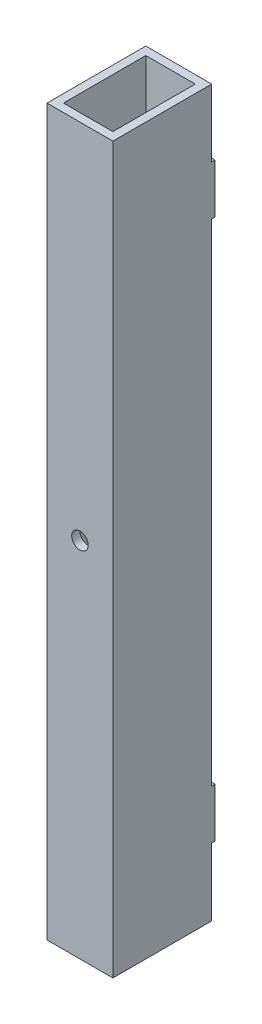
ISO-10303-21;
HEADER;
FILE_DESCRIPTION(('STEP AP214'),'2;1');
FILE_NAME('part.step','',(''),(''),'','','');
FILE_SCHEMA(('AUTOMOTIVE_DESIGN { 1 0 10303 214 1 1 1 1 }'));
ENDSEC;
DATA;
#1=APPLICATION_CONTEXT('core data for automotive mechanical design processes');
#2=APPLICATION_PROTOCOL_DEFINITION('international standard','automotive_design',2000,#1);
#3=PRODUCT_CONTEXT('',#1,'mechanical');
#4=PRODUCT('Part','Part','',(#3));
#5=PRODUCT_RELATED_PRODUCT_CATEGORY('part','',(#4));
#6=PRODUCT_DEFINITION_FORMATION('','',#4);
#7=PRODUCT_DEFINITION_CONTEXT('part definition',#1,'design');
#8=PRODUCT_DEFINITION('design','',#6,#7);
#9=PRODUCT_DEFINITION_SHAPE('','',#8);
#10=(LENGTH_UNIT() NAMED_UNIT(*) SI_UNIT(.MILLI.,.METRE.));
#11=(NAMED_UNIT(*) PLANE_ANGLE_UNIT() SI_UNIT($,.RADIAN.));
#12=(NAMED_UNIT(*) SI_UNIT($,.STERADIAN.) SOLID_ANGLE_UNIT());
#13=UNCERTAINTY_MEASURE_WITH_UNIT(LENGTH_MEASURE(1.E-05),#10,'distance_accuracy_value','');
#14=(GEOMETRIC_REPRESENTATION_CONTEXT(3) GLOBAL_UNCERTAINTY_ASSIGNED_CONTEXT((#13)) GLOBAL_UNIT_ASSIGNED_CONTEXT((#10,
#11,#12)) REPRESENTATION_CONTEXT('',''));
#15=CARTESIAN_POINT('',(0.,0.,0.));
#16=DIRECTION('',(0.,0.,1.));
#17=DIRECTION('',(1.,0.,0.));
#18=AXIS2_PLACEMENT_3D('',#15,#16,#17);
#19=CARTESIAN_POINT('',(-25.4,279.4,-38.1));
#20=DIRECTION('',(0.,0.,1.));
#21=DIRECTION('',(1.,0.,0.));
#22=AXIS2_PLACEMENT_3D('',#19,#20,#21);
#23=PLANE('',#22);
#24=CARTESIAN_POINT('',(0.,0.,-38.1));
#25=DIRECTION('',(0.,0.,1.));
#26=DIRECTION('',(1.,0.,0.));
#27=AXIS2_PLACEMENT_3D('',#24,#25,#26);
#28=CIRCLE('',#27,6.35);
#29=CARTESIAN_POINT('',(6.35,0.,-38.1));
#30=VERTEX_POINT('',#29);
#31=EDGE_CURVE('E239',#30,#30,#28,.T.);
#32=ORIENTED_EDGE('',*,*,#31,.T.);
#33=EDGE_LOOP('',(#32));
#34=FACE_BOUND('',#33,.T.);
#35=DIRECTION('',(0.,-1.,0.));
#36=VECTOR('',#35,1.);
#37=CARTESIAN_POINT('',(-25.4,279.4,-38.1));
#38=LINE('',#37,#36);
#39=CARTESIAN_POINT('',(-25.4,189.336065815908,-38.1));
#40=VERTEX_POINT('',#39);
#41=CARTESIAN_POINT('',(-25.4,-189.336065815908,-38.1));
#42=VERTEX_POINT('',#41);
#43=EDGE_CURVE('E221',#40,#42,#38,.T.);
#44=ORIENTED_EDGE('',*,*,#43,.F.);
#45=DIRECTION('',(1.,0.,0.));
#46=VECTOR('',#45,1.);
#47=CARTESIAN_POINT('',(25.4,189.336065815908,-38.1));
#48=LINE('',#47,#46);
#49=CARTESIAN_POINT('',(25.4,189.336065815908,-38.1));
#50=VERTEX_POINT('',#49);
#51=EDGE_CURVE('E51',#40,#50,#48,.T.);
#52=ORIENTED_EDGE('',*,*,#51,.T.);
#53=DIRECTION('',(0.,-1.,0.));
#54=VECTOR('',#53,1.);
#55=CARTESIAN_POINT('',(25.4,279.4,-38.1));
#56=LINE('',#55,#54);
#57=CARTESIAN_POINT('',(25.4,-189.336065815908,-38.1));
#58=VERTEX_POINT('',#57);
#59=EDGE_CURVE('E38',#50,#58,#56,.T.);
#60=ORIENTED_EDGE('',*,*,#59,.T.);
#61=DIRECTION('',(1.,0.,0.));
#62=VECTOR('',#61,1.);
#63=CARTESIAN_POINT('',(25.4,-189.336065815908,-38.1));
#64=LINE('',#63,#62);
#65=EDGE_CURVE('E186',#42,#58,#64,.T.);
#66=ORIENTED_EDGE('',*,*,#65,.F.);
#67=EDGE_LOOP('',(#44,#52,#60,#66));
#68=FACE_BOUND('',#67,.T.);
#69=ADVANCED_FACE('F34',(#34,#68),#23,.F.);
#70=CARTESIAN_POINT('',(25.4,279.4,-38.1));
#71=VERTEX_POINT('',#70);
#72=CARTESIAN_POINT('',(25.4,227.436065815908,-38.1));
#73=VERTEX_POINT('',#72);
#74=EDGE_CURVE('E11',#71,#73,#56,.T.);
#75=ORIENTED_EDGE('',*,*,#74,.T.);
#76=DIRECTION('',(-1.,0.,0.));
#77=VECTOR('',#76,1.);
#78=CARTESIAN_POINT('',(25.4,227.436065815908,-38.1));
#79=LINE('',#78,#77);
#80=CARTESIAN_POINT('',(-25.4,227.436065815908,-38.1));
#81=VERTEX_POINT('',#80);
#82=EDGE_CURVE('E166',#73,#81,#79,.T.);
#83=ORIENTED_EDGE('',*,*,#82,.T.);
#84=CARTESIAN_POINT('',(-25.4,279.4,-38.1));
#85=VERTEX_POINT('',#84);
#86=EDGE_CURVE('E223',#85,#81,#38,.T.);
#87=ORIENTED_EDGE('',*,*,#86,.F.);
#88=DIRECTION('',(-1.,0.,0.));
#89=VECTOR('',#88,1.);
#90=CARTESIAN_POINT('',(-25.4,279.4,-38.1));
#91=LINE('',#90,#89);
#92=EDGE_CURVE('E285',#71,#85,#91,.T.);
#93=ORIENTED_EDGE('',*,*,#92,.F.);
#94=EDGE_LOOP('',(#75,#83,#87,#93));
#95=FACE_BOUND('',#94,.T.);
#96=ADVANCED_FACE('F326',(#95),#23,.F.);
#97=DIRECTION('',(-1.,0.,0.));
#98=VECTOR('',#97,1.);
#99=CARTESIAN_POINT('',(25.4,-227.436065815908,-38.1));
#100=LINE('',#99,#98);
#101=CARTESIAN_POINT('',(25.4,-227.436065815908,-38.1));
#102=VERTEX_POINT('',#101);
#103=CARTESIAN_POINT('',(-25.4,-227.436065815908,-38.1));
#104=VERTEX_POINT('',#103);
#105=EDGE_CURVE('E59',#102,#104,#100,.T.);
#106=ORIENTED_EDGE('',*,*,#105,.F.);
#107=CARTESIAN_POINT('',(25.4,-279.4,-38.1));
#108=VERTEX_POINT('',#107);
#109=EDGE_CURVE('E200',#102,#108,#56,.T.);
#110=ORIENTED_EDGE('',*,*,#109,.T.);
#111=DIRECTION('',(-1.,0.,0.));
#112=VECTOR('',#111,1.);
#113=CARTESIAN_POINT('',(-25.4,-279.4,-38.1));
#114=LINE('',#113,#112);
#115=CARTESIAN_POINT('',(-25.4,-279.4,-38.1));
#116=VERTEX_POINT('',#115);
#117=EDGE_CURVE('E294',#108,#116,#114,.T.);
#118=ORIENTED_EDGE('',*,*,#117,.T.);
#119=EDGE_CURVE('E224',#104,#116,#38,.T.);
#120=ORIENTED_EDGE('',*,*,#119,.F.);
#121=EDGE_LOOP('',(#106,#110,#118,#120));
#122=FACE_BOUND('',#121,.T.);
#123=ADVANCED_FACE('F314',(#122),#23,.F.);
#124=CARTESIAN_POINT('',(25.4,279.4,-38.1));
#125=DIRECTION('',(0.,-1.,0.));
#126=DIRECTION('',(0.,0.,-1.));
#127=AXIS2_PLACEMENT_3D('',#124,#125,#126);
#128=PLANE('',#127);
#129=DIRECTION('',(0.,0.,-1.));
#130=VECTOR('',#129,1.);
#131=CARTESIAN_POINT('',(25.4,279.4,38.1));
#132=LINE('',#131,#130);
#133=CARTESIAN_POINT('',(25.4,279.4,38.1));
#134=VERTEX_POINT('',#133);
#135=EDGE_CURVE('E282',#134,#71,#132,.T.);
#136=ORIENTED_EDGE('',*,*,#135,.T.);
#137=ORIENTED_EDGE('',*,*,#92,.T.);
#138=DIRECTION('',(0.,0.,1.));
#139=VECTOR('',#138,1.);
#140=CARTESIAN_POINT('',(-25.4,279.4,38.1));
#141=LINE('',#140,#139);
#142=CARTESIAN_POINT('',(-25.4,279.4,38.1));
#143=VERTEX_POINT('',#142);
#144=EDGE_CURVE('E288',#85,#143,#141,.T.);
#145=ORIENTED_EDGE('',*,*,#144,.T.);
#146=DIRECTION('',(1.,0.,0.));
#147=VECTOR('',#146,1.);
#148=CARTESIAN_POINT('',(-25.4,279.4,38.1));
#149=LINE('',#148,#147);
#150=EDGE_CURVE('E290',#143,#134,#149,.T.);
#151=ORIENTED_EDGE('',*,*,#150,.T.);
#152=EDGE_LOOP('',(#136,#137,#145,#151));
#153=FACE_BOUND('',#152,.T.);
#154=DIRECTION('',(0.,0.,-1.));
#155=VECTOR('',#154,1.);
#156=CARTESIAN_POINT('',(19.05,279.4,31.75));
#157=LINE('',#156,#155);
#158=CARTESIAN_POINT('',(19.05,279.4,31.75));
#159=VERTEX_POINT('',#158);
#160=CARTESIAN_POINT('',(19.05,279.4,-31.75));
#161=VERTEX_POINT('',#160);
#162=EDGE_CURVE('E251',#159,#161,#157,.T.);
#163=ORIENTED_EDGE('',*,*,#162,.F.);
#164=DIRECTION('',(1.,0.,0.));
#165=VECTOR('',#164,1.);
#166=CARTESIAN_POINT('',(-19.05,279.4,31.75));
#167=LINE('',#166,#165);
#168=CARTESIAN_POINT('',(-19.05,279.4,31.75));
#169=VERTEX_POINT('',#168);
#170=EDGE_CURVE('E259',#169,#159,#167,.T.);
#171=ORIENTED_EDGE('',*,*,#170,.F.);
#172=DIRECTION('',(0.,0.,1.));
#173=VECTOR('',#172,1.);
#174=CARTESIAN_POINT('',(-19.05,279.4,31.75));
#175=LINE('',#174,#173);
#176=CARTESIAN_POINT('',(-19.05,279.4,-31.75));
#177=VERTEX_POINT('',#176);
#178=EDGE_CURVE('E256',#177,#169,#175,.T.);
#179=ORIENTED_EDGE('',*,*,#178,.F.);
#180=DIRECTION('',(-1.,0.,0.));
#181=VECTOR('',#180,1.);
#182=CARTESIAN_POINT('',(-19.05,279.4,-31.75));
#183=LINE('',#182,#181);
#184=EDGE_CURVE('E253',#161,#177,#183,.T.);
#185=ORIENTED_EDGE('',*,*,#184,.F.);
#186=EDGE_LOOP('',(#163,#171,#179,#185));
#187=FACE_BOUND('',#186,.T.);
#188=ADVANCED_FACE('F321',(#153,#187),#128,.F.);
#189=CARTESIAN_POINT('',(25.4,-279.4,-38.1));
#190=DIRECTION('',(0.,-1.,0.));
#191=DIRECTION('',(0.,0.,-1.));
#192=AXIS2_PLACEMENT_3D('',#189,#190,#191);
#193=PLANE('',#192);
#194=DIRECTION('',(0.,0.,-1.));
#195=VECTOR('',#194,1.);
#196=CARTESIAN_POINT('',(25.4,-279.4,38.1));
#197=LINE('',#196,#195);
#198=CARTESIAN_POINT('',(25.4,-279.4,38.1));
#199=VERTEX_POINT('',#198);
#200=EDGE_CURVE('E281',#199,#108,#197,.T.);
#201=ORIENTED_EDGE('',*,*,#200,.F.);
#202=DIRECTION('',(1.,0.,0.));
#203=VECTOR('',#202,1.);
#204=CARTESIAN_POINT('',(-25.4,-279.4,38.1));
#205=LINE('',#204,#203);
#206=CARTESIAN_POINT('',(-25.4,-279.4,38.1));
#207=VERTEX_POINT('',#206);
#208=EDGE_CURVE('E286',#207,#199,#205,.T.);
#209=ORIENTED_EDGE('',*,*,#208,.F.);
#210=DIRECTION('',(0.,0.,1.));
#211=VECTOR('',#210,1.);
#212=CARTESIAN_POINT('',(-25.4,-279.4,38.1));
#213=LINE('',#212,#211);
#214=EDGE_CURVE('E297',#116,#207,#213,.T.);
#215=ORIENTED_EDGE('',*,*,#214,.F.);
#216=ORIENTED_EDGE('',*,*,#117,.F.);
#217=EDGE_LOOP('',(#201,#209,#215,#216));
#218=FACE_BOUND('',#217,.T.);
#219=DIRECTION('',(1.,0.,0.));
#220=VECTOR('',#219,1.);
#221=CARTESIAN_POINT('',(-19.05,-279.4,31.75));
#222=LINE('',#221,#220);
#223=CARTESIAN_POINT('',(-19.05,-279.4,31.75));
#224=VERTEX_POINT('',#223);
#225=CARTESIAN_POINT('',(19.05,-279.4,31.75));
#226=VERTEX_POINT('',#225);
#227=EDGE_CURVE('E254',#224,#226,#222,.T.);
#228=ORIENTED_EDGE('',*,*,#227,.T.);
#229=DIRECTION('',(0.,0.,-1.));
#230=VECTOR('',#229,1.);
#231=CARTESIAN_POINT('',(19.05,-279.4,31.75));
#232=LINE('',#231,#230);
#233=CARTESIAN_POINT('',(19.05,-279.4,-31.75));
#234=VERTEX_POINT('',#233);
#235=EDGE_CURVE('E243',#226,#234,#232,.T.);
#236=ORIENTED_EDGE('',*,*,#235,.T.);
#237=DIRECTION('',(-1.,0.,0.));
#238=VECTOR('',#237,1.);
#239=CARTESIAN_POINT('',(-19.05,-279.4,-31.75));
#240=LINE('',#239,#238);
#241=CARTESIAN_POINT('',(-19.05,-279.4,-31.75));
#242=VERTEX_POINT('',#241);
#243=EDGE_CURVE('E264',#234,#242,#240,.T.);
#244=ORIENTED_EDGE('',*,*,#243,.T.);
#245=DIRECTION('',(0.,0.,1.));
#246=VECTOR('',#245,1.);
#247=CARTESIAN_POINT('',(-19.05,-279.4,31.75));
#248=LINE('',#247,#246);
#249=EDGE_CURVE('E267',#242,#224,#248,.T.);
#250=ORIENTED_EDGE('',*,*,#249,.T.);
#251=EDGE_LOOP('',(#228,#236,#244,#250));
#252=FACE_BOUND('',#251,.T.);
#253=ADVANCED_FACE('F316',(#218,#252),#193,.T.);
#254=CARTESIAN_POINT('',(25.4,279.4,38.1));
#255=DIRECTION('',(-1.,0.,0.));
#256=DIRECTION('',(0.,0.,1.));
#257=AXIS2_PLACEMENT_3D('',#254,#255,#256);
#258=PLANE('',#257);
#259=ORIENTED_EDGE('',*,*,#200,.T.);
#260=ORIENTED_EDGE('',*,*,#109,.F.);
#261=DIRECTION('',(0.,0.,1.));
#262=VECTOR('',#261,1.);
#263=CARTESIAN_POINT('',(25.4,-227.436065815908,-40.64));
#264=LINE('',#263,#262);
#265=CARTESIAN_POINT('',(25.4,-227.436065815908,-40.64));
#266=VERTEX_POINT('',#265);
#267=EDGE_CURVE('E204',#266,#102,#264,.T.);
#268=ORIENTED_EDGE('',*,*,#267,.F.);
#269=DIRECTION('',(0.,-1.,0.));
#270=VECTOR('',#269,1.);
#271=CARTESIAN_POINT('',(25.4,-227.436065815908,-40.64));
#272=LINE('',#271,#270);
#273=CARTESIAN_POINT('',(25.4,-189.336065815908,-40.64));
#274=VERTEX_POINT('',#273);
#275=EDGE_CURVE('E182',#274,#266,#272,.T.);
#276=ORIENTED_EDGE('',*,*,#275,.F.);
#277=DIRECTION('',(0.,0.,1.));
#278=VECTOR('',#277,1.);
#279=CARTESIAN_POINT('',(25.4,-189.336065815908,-40.64));
#280=LINE('',#279,#278);
#281=EDGE_CURVE('E192',#274,#58,#280,.T.);
#282=ORIENTED_EDGE('',*,*,#281,.T.);
#283=ORIENTED_EDGE('',*,*,#59,.F.);
#284=DIRECTION('',(0.,0.,1.));
#285=VECTOR('',#284,1.);
#286=CARTESIAN_POINT('',(25.4,189.336065815908,-40.64));
#287=LINE('',#286,#285);
#288=CARTESIAN_POINT('',(25.4,189.336065815908,-40.64));
#289=VERTEX_POINT('',#288);
#290=EDGE_CURVE('E149',#289,#50,#287,.T.);
#291=ORIENTED_EDGE('',*,*,#290,.F.);
#292=DIRECTION('',(0.,1.,0.));
#293=VECTOR('',#292,1.);
#294=CARTESIAN_POINT('',(25.4,227.436065815908,-40.64));
#295=LINE('',#294,#293);
#296=CARTESIAN_POINT('',(25.4,227.436065815908,-40.64));
#297=VERTEX_POINT('',#296);
#298=EDGE_CURVE('E152',#289,#297,#295,.T.);
#299=ORIENTED_EDGE('',*,*,#298,.T.);
#300=DIRECTION('',(0.,0.,1.));
#301=VECTOR('',#300,1.);
#302=CARTESIAN_POINT('',(25.4,227.436065815908,-40.64));
#303=LINE('',#302,#301);
#304=EDGE_CURVE('E174',#297,#73,#303,.T.);
#305=ORIENTED_EDGE('',*,*,#304,.T.);
#306=ORIENTED_EDGE('',*,*,#74,.F.);
#307=ORIENTED_EDGE('',*,*,#135,.F.);
#308=DIRECTION('',(0.,-1.,0.));
#309=VECTOR('',#308,1.);
#310=CARTESIAN_POINT('',(25.4,279.4,38.1));
#311=LINE('',#310,#309);
#312=EDGE_CURVE('E292',#134,#199,#311,.T.);
#313=ORIENTED_EDGE('',*,*,#312,.T.);
#314=EDGE_LOOP('',(#259,#260,#268,#276,#282,#283,#291,#299,#305,#306,#307,#313));
#315=FACE_BOUND('',#314,.T.);
#316=ADVANCED_FACE('F36',(#315),#258,.F.);
#317=CARTESIAN_POINT('',(-25.4,279.4,38.1));
#318=DIRECTION('',(1.,0.,0.));
#319=DIRECTION('',(0.,0.,-1.));
#320=AXIS2_PLACEMENT_3D('',#317,#318,#319);
#321=PLANE('',#320);
#322=ORIENTED_EDGE('',*,*,#214,.T.);
#323=DIRECTION('',(0.,-1.,0.));
#324=VECTOR('',#323,1.);
#325=CARTESIAN_POINT('',(-25.4,279.4,38.1));
#326=LINE('',#325,#324);
#327=EDGE_CURVE('E227',#143,#207,#326,.T.);
#328=ORIENTED_EDGE('',*,*,#327,.F.);
#329=ORIENTED_EDGE('',*,*,#144,.F.);
#330=ORIENTED_EDGE('',*,*,#86,.T.);
#331=DIRECTION('',(0.,0.,1.));
#332=VECTOR('',#331,1.);
#333=CARTESIAN_POINT('',(-25.4,227.436065815908,-40.64));
#334=LINE('',#333,#332);
#335=CARTESIAN_POINT('',(-25.4,227.436065815908,-40.64));
#336=VERTEX_POINT('',#335);
#337=EDGE_CURVE('E179',#336,#81,#334,.T.);
#338=ORIENTED_EDGE('',*,*,#337,.F.);
#339=DIRECTION('',(0.,-1.,0.));
#340=VECTOR('',#339,1.);
#341=CARTESIAN_POINT('',(-25.4,227.436065815908,-40.64));
#342=LINE('',#341,#340);
#343=CARTESIAN_POINT('',(-25.4,189.336065815908,-40.64));
#344=VERTEX_POINT('',#343);
#345=EDGE_CURVE('E169',#336,#344,#342,.T.);
#346=ORIENTED_EDGE('',*,*,#345,.T.);
#347=DIRECTION('',(0.,0.,1.));
#348=VECTOR('',#347,1.);
#349=CARTESIAN_POINT('',(-25.4,189.336065815908,-40.64));
#350=LINE('',#349,#348);
#351=EDGE_CURVE('E156',#344,#40,#350,.T.);
#352=ORIENTED_EDGE('',*,*,#351,.T.);
#353=ORIENTED_EDGE('',*,*,#43,.T.);
#354=DIRECTION('',(0.,0.,1.));
#355=VECTOR('',#354,1.);
#356=CARTESIAN_POINT('',(-25.4,-189.336065815908,-40.64));
#357=LINE('',#356,#355);
#358=CARTESIAN_POINT('',(-25.4,-189.336065815908,-40.64));
#359=VERTEX_POINT('',#358);
#360=EDGE_CURVE('E205',#359,#42,#357,.T.);
#361=ORIENTED_EDGE('',*,*,#360,.F.);
#362=DIRECTION('',(0.,1.,0.));
#363=VECTOR('',#362,1.);
#364=CARTESIAN_POINT('',(-25.4,-227.436065815908,-40.64));
#365=LINE('',#364,#363);
#366=CARTESIAN_POINT('',(-25.4,-227.436065815908,-40.64));
#367=VERTEX_POINT('',#366);
#368=EDGE_CURVE('E188',#367,#359,#365,.T.);
#369=ORIENTED_EDGE('',*,*,#368,.F.);
#370=DIRECTION('',(0.,0.,1.));
#371=VECTOR('',#370,1.);
#372=CARTESIAN_POINT('',(-25.4,-227.436065815908,-40.64));
#373=LINE('',#372,#371);
#374=EDGE_CURVE('E201',#367,#104,#373,.T.);
#375=ORIENTED_EDGE('',*,*,#374,.T.);
#376=ORIENTED_EDGE('',*,*,#119,.T.);
#377=EDGE_LOOP('',(#322,#328,#329,#330,#338,#346,#352,#353,#361,#369,#375,#376));
#378=FACE_BOUND('',#377,.T.);
#379=ADVANCED_FACE('F309',(#378),#321,.F.);
#380=CARTESIAN_POINT('',(-25.4,279.4,38.1));
#381=DIRECTION('',(0.,0.,-1.));
#382=DIRECTION('',(-1.,0.,0.));
#383=AXIS2_PLACEMENT_3D('',#380,#381,#382);
#384=PLANE('',#383);
#385=CARTESIAN_POINT('',(0.,0.,38.1));
#386=DIRECTION('',(0.,0.,1.));
#387=DIRECTION('',(1.,0.,0.));
#388=AXIS2_PLACEMENT_3D('',#385,#386,#387);
#389=CIRCLE('',#388,6.35);
#390=CARTESIAN_POINT('',(6.35,0.,38.1));
#391=VERTEX_POINT('',#390);
#392=EDGE_CURVE('E210',#391,#391,#389,.T.);
#393=ORIENTED_EDGE('',*,*,#392,.F.);
#394=EDGE_LOOP('',(#393));
#395=FACE_BOUND('',#394,.T.);
#396=ORIENTED_EDGE('',*,*,#208,.T.);
#397=ORIENTED_EDGE('',*,*,#312,.F.);
#398=ORIENTED_EDGE('',*,*,#150,.F.);
#399=ORIENTED_EDGE('',*,*,#327,.T.);
#400=EDGE_LOOP('',(#396,#397,#398,#399));
#401=FACE_BOUND('',#400,.T.);
#402=ADVANCED_FACE('F318',(#395,#401),#384,.F.);
#403=CARTESIAN_POINT('',(19.05,279.4,31.75));
#404=DIRECTION('',(-1.,0.,0.));
#405=DIRECTION('',(0.,0.,1.));
#406=AXIS2_PLACEMENT_3D('',#403,#404,#405);
#407=PLANE('',#406);
#408=ORIENTED_EDGE('',*,*,#235,.F.);
#409=DIRECTION('',(0.,-1.,0.));
#410=VECTOR('',#409,1.);
#411=CARTESIAN_POINT('',(19.05,279.4,31.75));
#412=LINE('',#411,#410);
#413=EDGE_CURVE('E261',#159,#226,#412,.T.);
#414=ORIENTED_EDGE('',*,*,#413,.F.);
#415=ORIENTED_EDGE('',*,*,#162,.T.);
#416=DIRECTION('',(0.,-1.,0.));
#417=VECTOR('',#416,1.);
#418=CARTESIAN_POINT('',(19.05,279.4,-31.75));
#419=LINE('',#418,#417);
#420=EDGE_CURVE('E278',#161,#234,#419,.T.);
#421=ORIENTED_EDGE('',*,*,#420,.T.);
#422=EDGE_LOOP('',(#408,#414,#415,#421));
#423=FACE_BOUND('',#422,.T.);
#424=ADVANCED_FACE('F355',(#423),#407,.T.);
#425=CARTESIAN_POINT('',(-19.05,279.4,-31.75));
#426=DIRECTION('',(0.,0.,1.));
#427=DIRECTION('',(1.,0.,0.));
#428=AXIS2_PLACEMENT_3D('',#425,#426,#427);
#429=PLANE('',#428);
#430=CARTESIAN_POINT('',(0.,0.,-31.75));
#431=DIRECTION('',(0.,0.,1.));
#432=DIRECTION('',(1.,0.,0.));
#433=AXIS2_PLACEMENT_3D('',#430,#431,#432);
#434=CIRCLE('',#433,6.35);
#435=CARTESIAN_POINT('',(6.35,0.,-31.75));
#436=VERTEX_POINT('',#435);
#437=EDGE_CURVE('E238',#436,#436,#434,.T.);
#438=ORIENTED_EDGE('',*,*,#437,.F.);
#439=EDGE_LOOP('',(#438));
#440=FACE_BOUND('',#439,.T.);
#441=ORIENTED_EDGE('',*,*,#243,.F.);
#442=ORIENTED_EDGE('',*,*,#420,.F.);
#443=ORIENTED_EDGE('',*,*,#184,.T.);
#444=DIRECTION('',(0.,-1.,0.));
#445=VECTOR('',#444,1.);
#446=CARTESIAN_POINT('',(-19.05,279.4,-31.75));
#447=LINE('',#446,#445);
#448=EDGE_CURVE('E276',#177,#242,#447,.T.);
#449=ORIENTED_EDGE('',*,*,#448,.T.);
#450=EDGE_LOOP('',(#441,#442,#443,#449));
#451=FACE_BOUND('',#450,.T.);
#452=ADVANCED_FACE('F383',(#440,#451),#429,.T.);
#453=CARTESIAN_POINT('',(-19.05,279.4,31.75));
#454=DIRECTION('',(1.,0.,0.));
#455=DIRECTION('',(0.,0.,-1.));
#456=AXIS2_PLACEMENT_3D('',#453,#454,#455);
#457=PLANE('',#456);
#458=ORIENTED_EDGE('',*,*,#249,.F.);
#459=ORIENTED_EDGE('',*,*,#448,.F.);
#460=ORIENTED_EDGE('',*,*,#178,.T.);
#461=DIRECTION('',(0.,-1.,0.));
#462=VECTOR('',#461,1.);
#463=CARTESIAN_POINT('',(-19.05,279.4,31.75));
#464=LINE('',#463,#462);
#465=EDGE_CURVE('E274',#169,#224,#464,.T.);
#466=ORIENTED_EDGE('',*,*,#465,.T.);
#467=EDGE_LOOP('',(#458,#459,#460,#466));
#468=FACE_BOUND('',#467,.T.);
#469=ADVANCED_FACE('F391',(#468),#457,.T.);
#470=CARTESIAN_POINT('',(-19.05,279.4,31.75));
#471=DIRECTION('',(0.,0.,-1.));
#472=DIRECTION('',(-1.,0.,0.));
#473=AXIS2_PLACEMENT_3D('',#470,#471,#472);
#474=PLANE('',#473);
#475=CARTESIAN_POINT('',(0.,0.,31.75));
#476=DIRECTION('',(0.,0.,-1.));
#477=DIRECTION('',(-1.,0.,0.));
#478=AXIS2_PLACEMENT_3D('',#475,#476,#477);
#479=CIRCLE('',#478,6.35);
#480=CARTESIAN_POINT('',(-6.35,0.,31.75));
#481=VERTEX_POINT('',#480);
#482=EDGE_CURVE('E236',#481,#481,#479,.T.);
#483=ORIENTED_EDGE('',*,*,#482,.F.);
#484=EDGE_LOOP('',(#483));
#485=FACE_BOUND('',#484,.T.);
#486=ORIENTED_EDGE('',*,*,#227,.F.);
#487=ORIENTED_EDGE('',*,*,#465,.F.);
#488=ORIENTED_EDGE('',*,*,#170,.T.);
#489=ORIENTED_EDGE('',*,*,#413,.T.);
#490=EDGE_LOOP('',(#486,#487,#488,#489));
#491=FACE_BOUND('',#490,.T.);
#492=ADVANCED_FACE('F396',(#485,#491),#474,.T.);
#493=CARTESIAN_POINT('',(0.,0.,-38.1));
#494=DIRECTION('',(0.,0.,1.));
#495=DIRECTION('',(1.,0.,0.));
#496=AXIS2_PLACEMENT_3D('',#493,#494,#495);
#497=CYLINDRICAL_SURFACE('',#496,6.35);
#498=ORIENTED_EDGE('',*,*,#482,.T.);
#499=EDGE_LOOP('',(#498));
#500=FACE_BOUND('',#499,.T.);
#501=ORIENTED_EDGE('',*,*,#392,.T.);
#502=EDGE_LOOP('',(#501));
#503=FACE_BOUND('',#502,.T.);
#504=ADVANCED_FACE('F418',(#500,#503),#497,.F.);
#505=ORIENTED_EDGE('',*,*,#437,.T.);
#506=EDGE_LOOP('',(#505));
#507=FACE_BOUND('',#506,.T.);
#508=ORIENTED_EDGE('',*,*,#31,.F.);
#509=EDGE_LOOP('',(#508));
#510=FACE_BOUND('',#509,.T.);
#511=ADVANCED_FACE('F428',(#507,#510),#497,.F.);
#512=CARTESIAN_POINT('',(25.4,-227.436065815908,-40.64));
#513=DIRECTION('',(0.,1.,0.));
#514=DIRECTION('',(0.,0.,1.));
#515=AXIS2_PLACEMENT_3D('',#512,#513,#514);
#516=PLANE('',#515);
#517=ORIENTED_EDGE('',*,*,#105,.T.);
#518=ORIENTED_EDGE('',*,*,#374,.F.);
#519=DIRECTION('',(-1.,0.,0.));
#520=VECTOR('',#519,1.);
#521=CARTESIAN_POINT('',(25.4,-227.436065815908,-40.64));
#522=LINE('',#521,#520);
#523=EDGE_CURVE('E185',#266,#367,#522,.T.);
#524=ORIENTED_EDGE('',*,*,#523,.F.);
#525=ORIENTED_EDGE('',*,*,#267,.T.);
#526=EDGE_LOOP('',(#517,#518,#524,#525));
#527=FACE_BOUND('',#526,.T.);
#528=ADVANCED_FACE('F436',(#527),#516,.F.);
#529=CARTESIAN_POINT('',(25.4,-189.336065815908,-40.64));
#530=DIRECTION('',(0.,-1.,0.));
#531=DIRECTION('',(1.,0.,0.));
#532=AXIS2_PLACEMENT_3D('',#529,#530,#531);
#533=PLANE('',#532);
#534=ORIENTED_EDGE('',*,*,#65,.T.);
#535=ORIENTED_EDGE('',*,*,#281,.F.);
#536=DIRECTION('',(1.,0.,0.));
#537=VECTOR('',#536,1.);
#538=CARTESIAN_POINT('',(25.4,-189.336065815908,-40.64));
#539=LINE('',#538,#537);
#540=EDGE_CURVE('E190',#359,#274,#539,.T.);
#541=ORIENTED_EDGE('',*,*,#540,.F.);
#542=ORIENTED_EDGE('',*,*,#360,.T.);
#543=EDGE_LOOP('',(#534,#535,#541,#542));
#544=FACE_BOUND('',#543,.T.);
#545=ADVANCED_FACE('F451',(#544),#533,.F.);
#546=CARTESIAN_POINT('',(25.4,-189.336065815908,-40.64));
#547=DIRECTION('',(0.,0.,1.));
#548=DIRECTION('',(1.,0.,0.));
#549=AXIS2_PLACEMENT_3D('',#546,#547,#548);
#550=PLANE('',#549);
#551=ORIENTED_EDGE('',*,*,#275,.T.);
#552=ORIENTED_EDGE('',*,*,#523,.T.);
#553=ORIENTED_EDGE('',*,*,#368,.T.);
#554=ORIENTED_EDGE('',*,*,#540,.T.);
#555=EDGE_LOOP('',(#551,#552,#553,#554));
#556=FACE_BOUND('',#555,.T.);
#557=ADVANCED_FACE('F337',(#556),#550,.F.);
#558=CARTESIAN_POINT('',(25.4,189.336065815908,-40.64));
#559=DIRECTION('',(0.,-1.,0.));
#560=DIRECTION('',(1.,0.,0.));
#561=AXIS2_PLACEMENT_3D('',#558,#559,#560);
#562=PLANE('',#561);
#563=ORIENTED_EDGE('',*,*,#51,.F.);
#564=ORIENTED_EDGE('',*,*,#351,.F.);
#565=DIRECTION('',(1.,0.,0.));
#566=VECTOR('',#565,1.);
#567=CARTESIAN_POINT('',(25.4,189.336065815908,-40.64));
#568=LINE('',#567,#566);
#569=EDGE_CURVE('E162',#344,#289,#568,.T.);
#570=ORIENTED_EDGE('',*,*,#569,.T.);
#571=ORIENTED_EDGE('',*,*,#290,.T.);
#572=EDGE_LOOP('',(#563,#564,#570,#571));
#573=FACE_BOUND('',#572,.T.);
#574=ADVANCED_FACE('F168',(#573),#562,.T.);
#575=CARTESIAN_POINT('',(25.4,227.436065815908,-40.64));
#576=DIRECTION('',(0.,1.,0.));
#577=DIRECTION('',(0.,0.,1.));
#578=AXIS2_PLACEMENT_3D('',#575,#576,#577);
#579=PLANE('',#578);
#580=ORIENTED_EDGE('',*,*,#82,.F.);
#581=ORIENTED_EDGE('',*,*,#304,.F.);
#582=DIRECTION('',(-1.,0.,0.));
#583=VECTOR('',#582,1.);
#584=CARTESIAN_POINT('',(25.4,227.436065815908,-40.64));
#585=LINE('',#584,#583);
#586=EDGE_CURVE('E165',#297,#336,#585,.T.);
#587=ORIENTED_EDGE('',*,*,#586,.T.);
#588=ORIENTED_EDGE('',*,*,#337,.T.);
#589=EDGE_LOOP('',(#580,#581,#587,#588));
#590=FACE_BOUND('',#589,.T.);
#591=ADVANCED_FACE('F329',(#590),#579,.T.);
#592=CARTESIAN_POINT('',(25.4,189.336065815908,-40.64));
#593=DIRECTION('',(0.,0.,1.));
#594=DIRECTION('',(1.,0.,0.));
#595=AXIS2_PLACEMENT_3D('',#592,#593,#594);
#596=PLANE('',#595);
#597=ORIENTED_EDGE('',*,*,#298,.F.);
#598=ORIENTED_EDGE('',*,*,#569,.F.);
#599=ORIENTED_EDGE('',*,*,#345,.F.);
#600=ORIENTED_EDGE('',*,*,#586,.F.);
#601=EDGE_LOOP('',(#597,#598,#599,#600));
#602=FACE_BOUND('',#601,.T.);
#603=ADVANCED_FACE('F160',(#602),#596,.F.);
#604=CLOSED_SHELL('',(#69,#96,#123,#188,#253,#316,#379,#402,#424,#452,#469,#492,#504,#511,#528,
#545,#557,#574,#591,#603));
#605=MANIFOLD_SOLID_BREP('B2',#604);
#606=ADVANCED_BREP_SHAPE_REPRESENTATION('',(#18,#605),#14);
#607=SHAPE_DEFINITION_REPRESENTATION(#9,#606);
ENDSEC;
END-ISO-10303-21;
